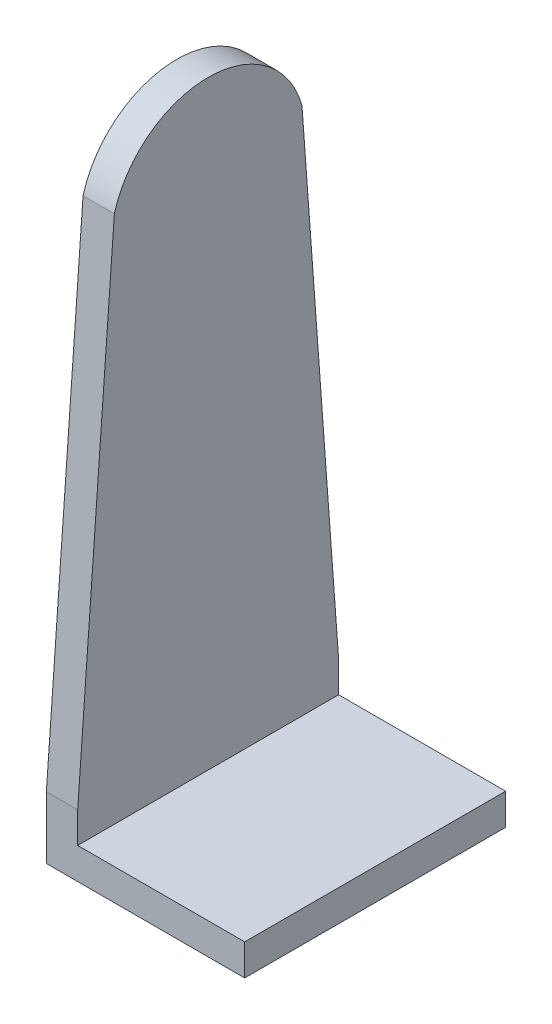
ISO-10303-21;
HEADER;
FILE_DESCRIPTION(('STEP AP214'),'2;1');
FILE_NAME('part.step','',(''),(''),'','','');
FILE_SCHEMA(('AUTOMOTIVE_DESIGN { 1 0 10303 214 1 1 1 1 }'));
ENDSEC;
DATA;
#1=APPLICATION_CONTEXT('core data for automotive mechanical design processes');
#2=APPLICATION_PROTOCOL_DEFINITION('international standard','automotive_design',2000,#1);
#3=PRODUCT_CONTEXT('',#1,'mechanical');
#4=PRODUCT('Part','Part','',(#3));
#5=PRODUCT_RELATED_PRODUCT_CATEGORY('part','',(#4));
#6=PRODUCT_DEFINITION_FORMATION('','',#4);
#7=PRODUCT_DEFINITION_CONTEXT('part definition',#1,'design');
#8=PRODUCT_DEFINITION('design','',#6,#7);
#9=PRODUCT_DEFINITION_SHAPE('','',#8);
#10=(LENGTH_UNIT() NAMED_UNIT(*) SI_UNIT(.MILLI.,.METRE.));
#11=(NAMED_UNIT(*) PLANE_ANGLE_UNIT() SI_UNIT($,.RADIAN.));
#12=(NAMED_UNIT(*) SI_UNIT($,.STERADIAN.) SOLID_ANGLE_UNIT());
#13=UNCERTAINTY_MEASURE_WITH_UNIT(LENGTH_MEASURE(1.E-05),#10,'distance_accuracy_value','');
#14=(GEOMETRIC_REPRESENTATION_CONTEXT(3) GLOBAL_UNCERTAINTY_ASSIGNED_CONTEXT((#13)) GLOBAL_UNIT_ASSIGNED_CONTEXT((#10,
#11,#12)) REPRESENTATION_CONTEXT('',''));
#15=CARTESIAN_POINT('',(0.,0.,0.));
#16=DIRECTION('',(0.,0.,1.));
#17=DIRECTION('',(1.,0.,0.));
#18=AXIS2_PLACEMENT_3D('',#15,#16,#17);
#19=CARTESIAN_POINT('',(16.5,-100.7,-12.5));
#20=DIRECTION('',(1.,0.,0.));
#21=DIRECTION('',(0.,-1.,0.));
#22=AXIS2_PLACEMENT_3D('',#19,#20,#21);
#23=PLANE('',#22);
#24=DIRECTION('',(0.,-0.997297605701587,-0.0734675823876265));
#25=VECTOR('',#24,1.);
#26=CARTESIAN_POINT('',(16.5,-100.681108800183,-12.7564416540415));
#27=LINE('',#26,#25);
#28=CARTESIAN_POINT('',(16.5,-49.5,-8.986100377806));
#29=VERTEX_POINT('',#28);
#30=CARTESIAN_POINT('',(16.5,-97.2,-12.5));
#31=VERTEX_POINT('',#30);
#32=EDGE_CURVE('E118',#29,#31,#27,.T.);
#33=ORIENTED_EDGE('',*,*,#32,.F.);
#34=CARTESIAN_POINT('',(16.5,-52.0000000000001,0.));
#35=DIRECTION('',(1.,0.,0.));
#36=DIRECTION('',(0.,0.,-1.));
#37=AXIS2_PLACEMENT_3D('',#34,#35,#36);
#38=CIRCLE('',#37,9.32737905308911);
#39=CARTESIAN_POINT('',(16.5,-49.5,8.986100377806));
#40=VERTEX_POINT('',#39);
#41=EDGE_CURVE('E154',#29,#40,#38,.T.);
#42=ORIENTED_EDGE('',*,*,#41,.T.);
#43=DIRECTION('',(0.,0.997297605701587,-0.0734675823876265));
#44=VECTOR('',#43,1.);
#45=CARTESIAN_POINT('',(16.5,-98.8493826998868,12.6215045124945));
#46=LINE('',#45,#44);
#47=CARTESIAN_POINT('',(16.5,-97.2,12.5));
#48=VERTEX_POINT('',#47);
#49=EDGE_CURVE('E148',#48,#40,#46,.T.);
#50=ORIENTED_EDGE('',*,*,#49,.F.);
#51=DIRECTION('',(0.,1.,0.));
#52=VECTOR('',#51,1.);
#53=CARTESIAN_POINT('',(16.5,-100.7,12.5));
#54=LINE('',#53,#52);
#55=CARTESIAN_POINT('',(16.5,-100.149489742783,12.5));
#56=VERTEX_POINT('',#55);
#57=EDGE_CURVE('E49',#56,#48,#54,.T.);
#58=ORIENTED_EDGE('',*,*,#57,.F.);
#59=DIRECTION('',(0.,0.,1.));
#60=VECTOR('',#59,1.);
#61=CARTESIAN_POINT('',(16.5,-100.149489742783,12.5));
#62=LINE('',#61,#60);
#63=CARTESIAN_POINT('',(16.5,-100.149489742783,-12.5));
#64=VERTEX_POINT('',#63);
#65=EDGE_CURVE('E116',#64,#56,#62,.T.);
#66=ORIENTED_EDGE('',*,*,#65,.F.);
#67=DIRECTION('',(0.,1.,0.));
#68=VECTOR('',#67,1.);
#69=CARTESIAN_POINT('',(16.5,-100.7,-12.5));
#70=LINE('',#69,#68);
#71=EDGE_CURVE('E11',#64,#31,#70,.T.);
#72=ORIENTED_EDGE('',*,*,#71,.T.);
#73=EDGE_LOOP('',(#33,#42,#50,#58,#66,#72));
#74=FACE_BOUND('',#73,.T.);
#75=ADVANCED_FACE('F39',(#74),#23,.T.);
#76=CARTESIAN_POINT('',(15.5,-70.85,12.5));
#77=DIRECTION('',(0.,0.,-1.));
#78=DIRECTION('',(0.,-1.,0.));
#79=AXIS2_PLACEMENT_3D('',#76,#77,#78);
#80=PLANE('',#79);
#81=DIRECTION('',(-1.,0.,0.));
#82=VECTOR('',#81,1.);
#83=CARTESIAN_POINT('',(32.5,-100.149489742783,12.5));
#84=LINE('',#83,#82);
#85=CARTESIAN_POINT('',(32.5,-100.149489742783,12.5));
#86=VERTEX_POINT('',#85);
#87=EDGE_CURVE('E112',#86,#56,#84,.T.);
#88=ORIENTED_EDGE('',*,*,#87,.T.);
#89=ORIENTED_EDGE('',*,*,#57,.T.);
#90=DIRECTION('',(-1.,0.,0.));
#91=VECTOR('',#90,1.);
#92=CARTESIAN_POINT('',(16.5,-97.2,12.5));
#93=LINE('',#92,#91);
#94=CARTESIAN_POINT('',(13.5,-97.2,12.5));
#95=VERTEX_POINT('',#94);
#96=EDGE_CURVE('E124',#48,#95,#93,.T.);
#97=ORIENTED_EDGE('',*,*,#96,.T.);
#98=DIRECTION('',(0.,-1.,0.));
#99=VECTOR('',#98,1.);
#100=CARTESIAN_POINT('',(13.5,0.,12.5));
#101=LINE('',#100,#99);
#102=CARTESIAN_POINT('',(13.5,-103.149489742783,12.5));
#103=VERTEX_POINT('',#102);
#104=EDGE_CURVE('E141',#95,#103,#101,.T.);
#105=ORIENTED_EDGE('',*,*,#104,.T.);
#106=DIRECTION('',(-1.,0.,0.));
#107=VECTOR('',#106,1.);
#108=CARTESIAN_POINT('',(75.6884089130718,-103.149489742783,12.5));
#109=LINE('',#108,#107);
#110=CARTESIAN_POINT('',(32.5,-103.149489742783,12.5));
#111=VERTEX_POINT('',#110);
#112=EDGE_CURVE('E103',#111,#103,#109,.T.);
#113=ORIENTED_EDGE('',*,*,#112,.F.);
#114=DIRECTION('',(0.,-1.,0.));
#115=VECTOR('',#114,1.);
#116=CARTESIAN_POINT('',(32.5,-103.149489742783,12.5));
#117=LINE('',#116,#115);
#118=EDGE_CURVE('E108',#86,#111,#117,.T.);
#119=ORIENTED_EDGE('',*,*,#118,.F.);
#120=EDGE_LOOP('',(#88,#89,#97,#105,#113,#119));
#121=FACE_BOUND('',#120,.T.);
#122=ADVANCED_FACE('F170',(#121),#80,.F.);
#123=CARTESIAN_POINT('',(15.93933982822,-101.76066017178,-12.5));
#124=DIRECTION('',(0.,0.,-1.));
#125=DIRECTION('',(1.,0.,0.));
#126=AXIS2_PLACEMENT_3D('',#123,#124,#125);
#127=PLANE('',#126);
#128=DIRECTION('',(-1.,0.,0.));
#129=VECTOR('',#128,1.);
#130=CARTESIAN_POINT('',(75.6884089130718,-103.149489742783,-12.5));
#131=LINE('',#130,#129);
#132=CARTESIAN_POINT('',(32.5,-103.149489742783,-12.5));
#133=VERTEX_POINT('',#132);
#134=CARTESIAN_POINT('',(13.5,-103.149489742783,-12.5));
#135=VERTEX_POINT('',#134);
#136=EDGE_CURVE('E90',#133,#135,#131,.T.);
#137=ORIENTED_EDGE('',*,*,#136,.T.);
#138=DIRECTION('',(0.,1.,0.));
#139=VECTOR('',#138,1.);
#140=CARTESIAN_POINT('',(13.5,0.,-12.5));
#141=LINE('',#140,#139);
#142=CARTESIAN_POINT('',(13.5,-97.2,-12.5));
#143=VERTEX_POINT('',#142);
#144=EDGE_CURVE('E139',#135,#143,#141,.T.);
#145=ORIENTED_EDGE('',*,*,#144,.T.);
#146=DIRECTION('',(-1.,0.,0.));
#147=VECTOR('',#146,1.);
#148=CARTESIAN_POINT('',(16.5,-97.2,-12.5));
#149=LINE('',#148,#147);
#150=EDGE_CURVE('E129',#31,#143,#149,.T.);
#151=ORIENTED_EDGE('',*,*,#150,.F.);
#152=ORIENTED_EDGE('',*,*,#71,.F.);
#153=DIRECTION('',(-1.,0.,0.));
#154=VECTOR('',#153,1.);
#155=CARTESIAN_POINT('',(32.5,-100.149489742783,-12.5));
#156=LINE('',#155,#154);
#157=CARTESIAN_POINT('',(32.5,-100.149489742783,-12.5));
#158=VERTEX_POINT('',#157);
#159=EDGE_CURVE('E69',#158,#64,#156,.T.);
#160=ORIENTED_EDGE('',*,*,#159,.F.);
#161=DIRECTION('',(0.,1.,0.));
#162=VECTOR('',#161,1.);
#163=CARTESIAN_POINT('',(32.5,-100.149489742783,-12.5));
#164=LINE('',#163,#162);
#165=EDGE_CURVE('E106',#133,#158,#164,.T.);
#166=ORIENTED_EDGE('',*,*,#165,.F.);
#167=EDGE_LOOP('',(#137,#145,#151,#152,#160,#166));
#168=FACE_BOUND('',#167,.T.);
#169=ADVANCED_FACE('F41',(#168),#127,.T.);
#170=CARTESIAN_POINT('',(75.6884089130718,-103.149489742783,-12.5));
#171=DIRECTION('',(0.,-1.,0.));
#172=DIRECTION('',(0.,0.,-1.));
#173=AXIS2_PLACEMENT_3D('',#170,#171,#172);
#174=PLANE('',#173);
#175=ORIENTED_EDGE('',*,*,#112,.T.);
#176=DIRECTION('',(0.,0.,-1.));
#177=VECTOR('',#176,1.);
#178=CARTESIAN_POINT('',(13.5,-103.149489742783,-12.5));
#179=LINE('',#178,#177);
#180=EDGE_CURVE('E97',#103,#135,#179,.T.);
#181=ORIENTED_EDGE('',*,*,#180,.T.);
#182=ORIENTED_EDGE('',*,*,#136,.F.);
#183=DIRECTION('',(0.,0.,-1.));
#184=VECTOR('',#183,1.);
#185=CARTESIAN_POINT('',(32.5,-103.149489742783,-12.5));
#186=LINE('',#185,#184);
#187=EDGE_CURVE('E94',#111,#133,#186,.T.);
#188=ORIENTED_EDGE('',*,*,#187,.F.);
#189=EDGE_LOOP('',(#175,#181,#182,#188));
#190=FACE_BOUND('',#189,.T.);
#191=ADVANCED_FACE('F93',(#190),#174,.T.);
#192=CARTESIAN_POINT('',(32.5,-100.149489742783,12.5));
#193=DIRECTION('',(0.,-1.,0.));
#194=DIRECTION('',(0.,0.,-1.));
#195=AXIS2_PLACEMENT_3D('',#192,#193,#194);
#196=PLANE('',#195);
#197=ORIENTED_EDGE('',*,*,#65,.T.);
#198=ORIENTED_EDGE('',*,*,#87,.F.);
#199=DIRECTION('',(0.,0.,1.));
#200=VECTOR('',#199,1.);
#201=CARTESIAN_POINT('',(32.5,-100.149489742783,12.5));
#202=LINE('',#201,#200);
#203=EDGE_CURVE('E58',#158,#86,#202,.T.);
#204=ORIENTED_EDGE('',*,*,#203,.F.);
#205=ORIENTED_EDGE('',*,*,#159,.T.);
#206=EDGE_LOOP('',(#197,#198,#204,#205));
#207=FACE_BOUND('',#206,.T.);
#208=ADVANCED_FACE('F200',(#207),#196,.F.);
#209=CARTESIAN_POINT('',(32.5,0.,0.));
#210=DIRECTION('',(-1.,0.,0.));
#211=DIRECTION('',(0.,0.,1.));
#212=AXIS2_PLACEMENT_3D('',#209,#210,#211);
#213=PLANE('',#212);
#214=ORIENTED_EDGE('',*,*,#118,.T.);
#215=ORIENTED_EDGE('',*,*,#187,.T.);
#216=ORIENTED_EDGE('',*,*,#165,.T.);
#217=ORIENTED_EDGE('',*,*,#203,.T.);
#218=EDGE_LOOP('',(#214,#215,#216,#217));
#219=FACE_BOUND('',#218,.T.);
#220=ADVANCED_FACE('F105',(#219),#213,.F.);
#221=CARTESIAN_POINT('',(22.,-49.5,-8.986100377806));
#222=DIRECTION('',(0.,-0.0734675823876265,0.997297605701587));
#223=DIRECTION('',(0.,-0.997297605701587,-0.0734675823876265));
#224=AXIS2_PLACEMENT_3D('',#221,#222,#223);
#225=PLANE('',#224);
#226=ORIENTED_EDGE('',*,*,#32,.T.);
#227=ORIENTED_EDGE('',*,*,#150,.T.);
#228=DIRECTION('',(0.,0.997297605701587,0.0734675823876265));
#229=VECTOR('',#228,1.);
#230=CARTESIAN_POINT('',(13.5,0.391227443813302,-5.31078035127329));
#231=LINE('',#230,#229);
#232=CARTESIAN_POINT('',(13.5,-49.5,-8.986100377806));
#233=VERTEX_POINT('',#232);
#234=EDGE_CURVE('E136',#143,#233,#231,.T.);
#235=ORIENTED_EDGE('',*,*,#234,.T.);
#236=DIRECTION('',(1.,0.,0.));
#237=VECTOR('',#236,1.);
#238=CARTESIAN_POINT('',(14.5,-49.5,-8.986100377806));
#239=LINE('',#238,#237);
#240=EDGE_CURVE('E43',#233,#29,#239,.T.);
#241=ORIENTED_EDGE('',*,*,#240,.T.);
#242=EDGE_LOOP('',(#226,#227,#235,#241));
#243=FACE_BOUND('',#242,.T.);
#244=ADVANCED_FACE('F133',(#243),#225,.F.);
#245=CARTESIAN_POINT('',(22.,-49.5,8.986100377806));
#246=DIRECTION('',(0.,-0.0734675823876265,-0.997297605701587));
#247=DIRECTION('',(0.,0.997297605701587,-0.0734675823876265));
#248=AXIS2_PLACEMENT_3D('',#245,#246,#247);
#249=PLANE('',#248);
#250=ORIENTED_EDGE('',*,*,#49,.T.);
#251=DIRECTION('',(1.,0.,0.));
#252=VECTOR('',#251,1.);
#253=CARTESIAN_POINT('',(14.5,-49.5,8.986100377806));
#254=LINE('',#253,#252);
#255=CARTESIAN_POINT('',(13.5,-49.5,8.986100377806));
#256=VERTEX_POINT('',#255);
#257=EDGE_CURVE('E102',#256,#40,#254,.T.);
#258=ORIENTED_EDGE('',*,*,#257,.F.);
#259=DIRECTION('',(0.,-0.997297605701587,0.0734675823876265));
#260=VECTOR('',#259,1.);
#261=CARTESIAN_POINT('',(13.5,0.391227443813302,5.31078035127329));
#262=LINE('',#261,#260);
#263=EDGE_CURVE('E161',#256,#95,#262,.T.);
#264=ORIENTED_EDGE('',*,*,#263,.T.);
#265=ORIENTED_EDGE('',*,*,#96,.F.);
#266=EDGE_LOOP('',(#250,#258,#264,#265));
#267=FACE_BOUND('',#266,.T.);
#268=ADVANCED_FACE('F177',(#267),#249,.F.);
#269=CARTESIAN_POINT('',(13.5,-52.0000000000001,0.));
#270=DIRECTION('',(1.,0.,0.));
#271=DIRECTION('',(0.,0.,-1.));
#272=AXIS2_PLACEMENT_3D('',#269,#270,#271);
#273=CYLINDRICAL_SURFACE('',#272,9.32737905308911);
#274=ORIENTED_EDGE('',*,*,#41,.F.);
#275=ORIENTED_EDGE('',*,*,#240,.F.);
#276=CARTESIAN_POINT('',(13.5,-52.0000000000001,0.));
#277=DIRECTION('',(1.,0.,0.));
#278=DIRECTION('',(0.,0.,-1.));
#279=AXIS2_PLACEMENT_3D('',#276,#277,#278);
#280=CIRCLE('',#279,9.32737905308911);
#281=EDGE_CURVE('E147',#233,#256,#280,.T.);
#282=ORIENTED_EDGE('',*,*,#281,.T.);
#283=ORIENTED_EDGE('',*,*,#257,.T.);
#284=EDGE_LOOP('',(#274,#275,#282,#283));
#285=FACE_BOUND('',#284,.T.);
#286=ADVANCED_FACE('F180',(#285),#273,.T.);
#287=CARTESIAN_POINT('',(13.5,0.,0.));
#288=DIRECTION('',(1.,0.,0.));
#289=DIRECTION('',(0.,0.,-1.));
#290=AXIS2_PLACEMENT_3D('',#287,#288,#289);
#291=PLANE('',#290);
#292=ORIENTED_EDGE('',*,*,#281,.F.);
#293=ORIENTED_EDGE('',*,*,#234,.F.);
#294=ORIENTED_EDGE('',*,*,#144,.F.);
#295=ORIENTED_EDGE('',*,*,#180,.F.);
#296=ORIENTED_EDGE('',*,*,#104,.F.);
#297=ORIENTED_EDGE('',*,*,#263,.F.);
#298=EDGE_LOOP('',(#292,#293,#294,#295,#296,#297));
#299=FACE_BOUND('',#298,.T.);
#300=ADVANCED_FACE('F144',(#299),#291,.F.);
#301=CLOSED_SHELL('',(#75,#122,#169,#191,#208,#220,#244,#268,#286,#300));
#302=MANIFOLD_SOLID_BREP('B2',#301);
#303=ADVANCED_BREP_SHAPE_REPRESENTATION('',(#18,#302),#14);
#304=SHAPE_DEFINITION_REPRESENTATION(#9,#303);
ENDSEC;
END-ISO-10303-21;
